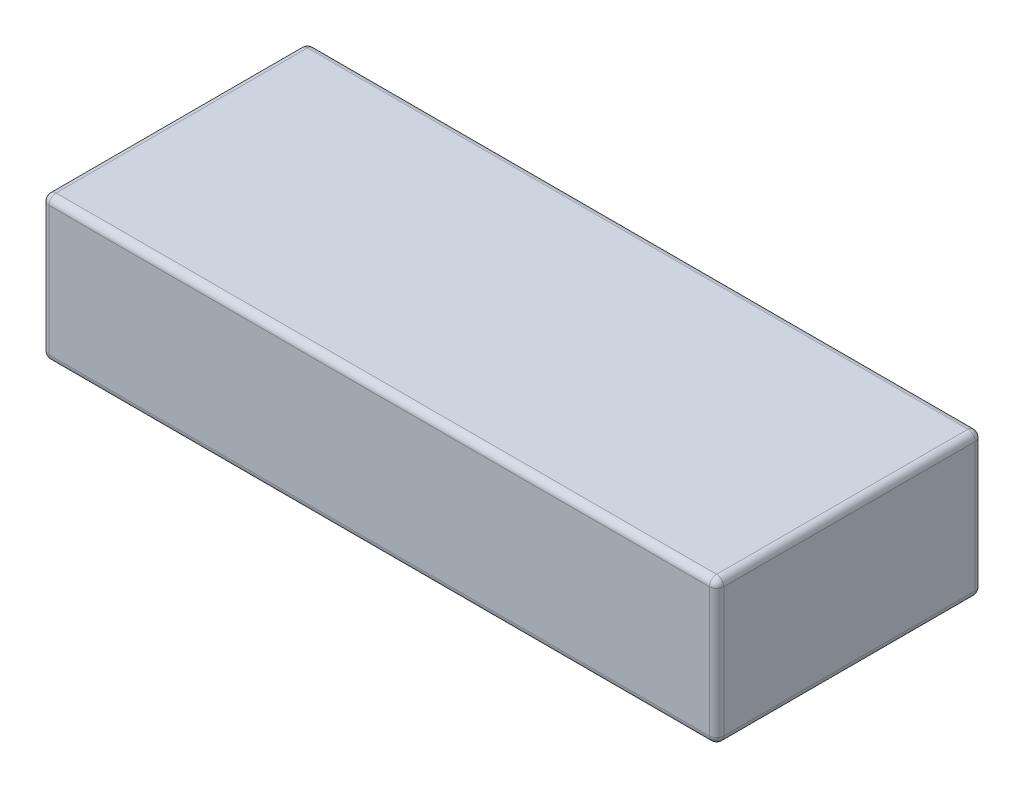
ISO-10303-21;
HEADER;
FILE_DESCRIPTION(('STEP AP214'),'2;1');
FILE_NAME('part.step','',(''),(''),'','','');
FILE_SCHEMA(('AUTOMOTIVE_DESIGN { 1 0 10303 214 1 1 1 1 }'));
ENDSEC;
DATA;
#1=APPLICATION_CONTEXT('core data for automotive mechanical design processes');
#2=APPLICATION_PROTOCOL_DEFINITION('international standard','automotive_design',2000,#1);
#3=PRODUCT_CONTEXT('',#1,'mechanical');
#4=PRODUCT('Part','Part','',(#3));
#5=PRODUCT_RELATED_PRODUCT_CATEGORY('part','',(#4));
#6=PRODUCT_DEFINITION_FORMATION('','',#4);
#7=PRODUCT_DEFINITION_CONTEXT('part definition',#1,'design');
#8=PRODUCT_DEFINITION('design','',#6,#7);
#9=PRODUCT_DEFINITION_SHAPE('','',#8);
#10=(LENGTH_UNIT() NAMED_UNIT(*) SI_UNIT(.MILLI.,.METRE.));
#11=(NAMED_UNIT(*) PLANE_ANGLE_UNIT() SI_UNIT($,.RADIAN.));
#12=(NAMED_UNIT(*) SI_UNIT($,.STERADIAN.) SOLID_ANGLE_UNIT());
#13=UNCERTAINTY_MEASURE_WITH_UNIT(LENGTH_MEASURE(1.E-05),#10,'distance_accuracy_value','');
#14=(GEOMETRIC_REPRESENTATION_CONTEXT(3) GLOBAL_UNCERTAINTY_ASSIGNED_CONTEXT((#13)) GLOBAL_UNIT_ASSIGNED_CONTEXT((#10,
#11,#12)) REPRESENTATION_CONTEXT('',''));
#15=CARTESIAN_POINT('',(0.,0.,0.));
#16=DIRECTION('',(0.,0.,1.));
#17=DIRECTION('',(1.,0.,0.));
#18=AXIS2_PLACEMENT_3D('',#15,#16,#17);
#19=CARTESIAN_POINT('',(0.,20.,0.));
#20=DIRECTION('',(1.,0.,0.));
#21=DIRECTION('',(0.,0.,-1.));
#22=AXIS2_PLACEMENT_3D('',#19,#20,#21);
#23=PLANE('',#22);
#24=DIRECTION('',(0.,-1.,0.));
#25=VECTOR('',#24,1.);
#26=CARTESIAN_POINT('',(0.,20.,-1.));
#27=LINE('',#26,#25);
#28=CARTESIAN_POINT('',(0.,1.,-1.));
#29=VERTEX_POINT('',#28);
#30=CARTESIAN_POINT('',(0.,19.,-1.));
#31=VERTEX_POINT('',#30);
#32=EDGE_CURVE('E131',#29,#31,#27,.F.);
#33=ORIENTED_EDGE('',*,*,#32,.T.);
#34=DIRECTION('',(0.,0.,1.));
#35=VECTOR('',#34,1.);
#36=CARTESIAN_POINT('',(0.,19.,0.));
#37=LINE('',#36,#35);
#38=CARTESIAN_POINT('',(0.,19.,-36.));
#39=VERTEX_POINT('',#38);
#40=EDGE_CURVE('E168',#31,#39,#37,.F.);
#41=ORIENTED_EDGE('',*,*,#40,.T.);
#42=DIRECTION('',(0.,-1.,0.));
#43=VECTOR('',#42,1.);
#44=CARTESIAN_POINT('',(0.,20.,-36.));
#45=LINE('',#44,#43);
#46=CARTESIAN_POINT('',(0.,1.,-36.));
#47=VERTEX_POINT('',#46);
#48=EDGE_CURVE('E165',#39,#47,#45,.T.);
#49=ORIENTED_EDGE('',*,*,#48,.T.);
#50=DIRECTION('',(0.,0.,1.));
#51=VECTOR('',#50,1.);
#52=CARTESIAN_POINT('',(0.,1.,0.));
#53=LINE('',#52,#51);
#54=EDGE_CURVE('E160',#47,#29,#53,.T.);
#55=ORIENTED_EDGE('',*,*,#54,.T.);
#56=EDGE_LOOP('',(#33,#41,#49,#55));
#57=FACE_BOUND('',#56,.T.);
#58=ADVANCED_FACE('F36',(#57),#23,.F.);
#59=CARTESIAN_POINT('',(0.,20.,0.));
#60=DIRECTION('',(0.,0.,-1.));
#61=DIRECTION('',(-1.,0.,0.));
#62=AXIS2_PLACEMENT_3D('',#59,#60,#61);
#63=PLANE('',#62);
#64=DIRECTION('',(0.,-1.,0.));
#65=VECTOR('',#64,1.);
#66=CARTESIAN_POINT('',(93.,20.,0.));
#67=LINE('',#66,#65);
#68=CARTESIAN_POINT('',(93.,1.,0.));
#69=VERTEX_POINT('',#68);
#70=CARTESIAN_POINT('',(93.,19.,0.));
#71=VERTEX_POINT('',#70);
#72=EDGE_CURVE('E153',#69,#71,#67,.F.);
#73=ORIENTED_EDGE('',*,*,#72,.T.);
#74=DIRECTION('',(1.,0.,0.));
#75=VECTOR('',#74,1.);
#76=CARTESIAN_POINT('',(0.,19.,0.));
#77=LINE('',#76,#75);
#78=CARTESIAN_POINT('',(1.,19.,0.));
#79=VERTEX_POINT('',#78);
#80=EDGE_CURVE('E157',#71,#79,#77,.F.);
#81=ORIENTED_EDGE('',*,*,#80,.T.);
#82=DIRECTION('',(0.,-1.,0.));
#83=VECTOR('',#82,1.);
#84=CARTESIAN_POINT('',(1.,20.,0.));
#85=LINE('',#84,#83);
#86=CARTESIAN_POINT('',(1.,1.,0.));
#87=VERTEX_POINT('',#86);
#88=EDGE_CURVE('E129',#79,#87,#85,.T.);
#89=ORIENTED_EDGE('',*,*,#88,.T.);
#90=DIRECTION('',(1.,0.,0.));
#91=VECTOR('',#90,1.);
#92=CARTESIAN_POINT('',(94.,1.,0.));
#93=LINE('',#92,#91);
#94=EDGE_CURVE('E147',#87,#69,#93,.T.);
#95=ORIENTED_EDGE('',*,*,#94,.T.);
#96=EDGE_LOOP('',(#73,#81,#89,#95));
#97=FACE_BOUND('',#96,.T.);
#98=ADVANCED_FACE('F155',(#97),#63,.F.);
#99=CARTESIAN_POINT('',(94.,20.,0.));
#100=DIRECTION('',(-1.,0.,0.));
#101=DIRECTION('',(0.,0.,1.));
#102=AXIS2_PLACEMENT_3D('',#99,#100,#101);
#103=PLANE('',#102);
#104=DIRECTION('',(0.,-1.,0.));
#105=VECTOR('',#104,1.);
#106=CARTESIAN_POINT('',(94.,20.,-36.));
#107=LINE('',#106,#105);
#108=CARTESIAN_POINT('',(94.,1.,-36.));
#109=VERTEX_POINT('',#108);
#110=CARTESIAN_POINT('',(94.,19.,-36.));
#111=VERTEX_POINT('',#110);
#112=EDGE_CURVE('E172',#109,#111,#107,.F.);
#113=ORIENTED_EDGE('',*,*,#112,.T.);
#114=DIRECTION('',(0.,0.,-1.));
#115=VECTOR('',#114,1.);
#116=CARTESIAN_POINT('',(94.,19.,0.));
#117=LINE('',#116,#115);
#118=CARTESIAN_POINT('',(94.,19.,-1.));
#119=VERTEX_POINT('',#118);
#120=EDGE_CURVE('E177',#111,#119,#117,.F.);
#121=ORIENTED_EDGE('',*,*,#120,.T.);
#122=DIRECTION('',(0.,-1.,0.));
#123=VECTOR('',#122,1.);
#124=CARTESIAN_POINT('',(94.,20.,-1.));
#125=LINE('',#124,#123);
#126=CARTESIAN_POINT('',(94.,1.,-1.));
#127=VERTEX_POINT('',#126);
#128=EDGE_CURVE('E174',#119,#127,#125,.T.);
#129=ORIENTED_EDGE('',*,*,#128,.T.);
#130=DIRECTION('',(0.,0.,-1.));
#131=VECTOR('',#130,1.);
#132=CARTESIAN_POINT('',(94.,1.,-37.));
#133=LINE('',#132,#131);
#134=EDGE_CURVE('E170',#127,#109,#133,.T.);
#135=ORIENTED_EDGE('',*,*,#134,.T.);
#136=EDGE_LOOP('',(#113,#121,#129,#135));
#137=FACE_BOUND('',#136,.T.);
#138=ADVANCED_FACE('F282',(#137),#103,.F.);
#139=CARTESIAN_POINT('',(0.,20.,-37.));
#140=DIRECTION('',(0.,0.,1.));
#141=DIRECTION('',(1.,0.,0.));
#142=AXIS2_PLACEMENT_3D('',#139,#140,#141);
#143=PLANE('',#142);
#144=DIRECTION('',(0.,-1.,0.));
#145=VECTOR('',#144,1.);
#146=CARTESIAN_POINT('',(1.00000000000001,20.,-37.));
#147=LINE('',#146,#145);
#148=CARTESIAN_POINT('',(1.00000000000001,1.,-37.));
#149=VERTEX_POINT('',#148);
#150=CARTESIAN_POINT('',(1.00000000000001,19.,-37.));
#151=VERTEX_POINT('',#150);
#152=EDGE_CURVE('E181',#149,#151,#147,.F.);
#153=ORIENTED_EDGE('',*,*,#152,.T.);
#154=DIRECTION('',(-1.,0.,0.));
#155=VECTOR('',#154,1.);
#156=CARTESIAN_POINT('',(0.,19.,-37.));
#157=LINE('',#156,#155);
#158=CARTESIAN_POINT('',(93.,19.,-37.));
#159=VERTEX_POINT('',#158);
#160=EDGE_CURVE('E186',#151,#159,#157,.F.);
#161=ORIENTED_EDGE('',*,*,#160,.T.);
#162=DIRECTION('',(0.,-1.,0.));
#163=VECTOR('',#162,1.);
#164=CARTESIAN_POINT('',(93.,20.,-37.));
#165=LINE('',#164,#163);
#166=CARTESIAN_POINT('',(93.,1.,-37.));
#167=VERTEX_POINT('',#166);
#168=EDGE_CURVE('E183',#159,#167,#165,.T.);
#169=ORIENTED_EDGE('',*,*,#168,.T.);
#170=DIRECTION('',(-1.,0.,0.));
#171=VECTOR('',#170,1.);
#172=CARTESIAN_POINT('',(0.,1.,-37.));
#173=LINE('',#172,#171);
#174=EDGE_CURVE('E179',#167,#149,#173,.T.);
#175=ORIENTED_EDGE('',*,*,#174,.T.);
#176=EDGE_LOOP('',(#153,#161,#169,#175));
#177=FACE_BOUND('',#176,.T.);
#178=ADVANCED_FACE('F292',(#177),#143,.F.);
#179=CARTESIAN_POINT('',(0.,20.,0.));
#180=DIRECTION('',(0.,-1.,0.));
#181=DIRECTION('',(0.,0.,-1.));
#182=AXIS2_PLACEMENT_3D('',#179,#180,#181);
#183=PLANE('',#182);
#184=DIRECTION('',(0.,0.,-1.));
#185=VECTOR('',#184,1.);
#186=CARTESIAN_POINT('',(93.,20.,0.));
#187=LINE('',#186,#185);
#188=CARTESIAN_POINT('',(93.,20.,-1.));
#189=VERTEX_POINT('',#188);
#190=CARTESIAN_POINT('',(93.,20.,-36.));
#191=VERTEX_POINT('',#190);
#192=EDGE_CURVE('E192',#189,#191,#187,.T.);
#193=ORIENTED_EDGE('',*,*,#192,.T.);
#194=DIRECTION('',(-1.,0.,0.));
#195=VECTOR('',#194,1.);
#196=CARTESIAN_POINT('',(0.,20.,-36.));
#197=LINE('',#196,#195);
#198=CARTESIAN_POINT('',(1.00000000000001,20.,-36.));
#199=VERTEX_POINT('',#198);
#200=EDGE_CURVE('E194',#191,#199,#197,.T.);
#201=ORIENTED_EDGE('',*,*,#200,.T.);
#202=DIRECTION('',(0.,0.,1.));
#203=VECTOR('',#202,1.);
#204=CARTESIAN_POINT('',(1.,20.,0.));
#205=LINE('',#204,#203);
#206=CARTESIAN_POINT('',(1.,20.,-1.));
#207=VERTEX_POINT('',#206);
#208=EDGE_CURVE('E188',#199,#207,#205,.T.);
#209=ORIENTED_EDGE('',*,*,#208,.T.);
#210=DIRECTION('',(1.,0.,0.));
#211=VECTOR('',#210,1.);
#212=CARTESIAN_POINT('',(0.,20.,-1.));
#213=LINE('',#212,#211);
#214=EDGE_CURVE('E190',#207,#189,#213,.T.);
#215=ORIENTED_EDGE('',*,*,#214,.T.);
#216=EDGE_LOOP('',(#193,#201,#209,#215));
#217=FACE_BOUND('',#216,.T.);
#218=ADVANCED_FACE('F274',(#217),#183,.F.);
#219=CARTESIAN_POINT('',(0.,0.,0.));
#220=DIRECTION('',(0.,-1.,0.));
#221=DIRECTION('',(0.,0.,-1.));
#222=AXIS2_PLACEMENT_3D('',#219,#220,#221);
#223=PLANE('',#222);
#224=DIRECTION('',(0.,0.,1.));
#225=VECTOR('',#224,1.);
#226=CARTESIAN_POINT('',(1.00000000000001,0.,-37.));
#227=LINE('',#226,#225);
#228=CARTESIAN_POINT('',(1.,0.,-1.));
#229=VERTEX_POINT('',#228);
#230=CARTESIAN_POINT('',(1.00000000000001,0.,-36.));
#231=VERTEX_POINT('',#230);
#232=EDGE_CURVE('E197',#229,#231,#227,.F.);
#233=ORIENTED_EDGE('',*,*,#232,.T.);
#234=DIRECTION('',(-1.,0.,0.));
#235=VECTOR('',#234,1.);
#236=CARTESIAN_POINT('',(94.,0.,-36.));
#237=LINE('',#236,#235);
#238=CARTESIAN_POINT('',(93.,0.,-36.));
#239=VERTEX_POINT('',#238);
#240=EDGE_CURVE('E11',#231,#239,#237,.F.);
#241=ORIENTED_EDGE('',*,*,#240,.T.);
#242=DIRECTION('',(0.,0.,-1.));
#243=VECTOR('',#242,1.);
#244=CARTESIAN_POINT('',(93.,0.,0.));
#245=LINE('',#244,#243);
#246=CARTESIAN_POINT('',(93.,0.,-1.));
#247=VERTEX_POINT('',#246);
#248=EDGE_CURVE('E45',#239,#247,#245,.F.);
#249=ORIENTED_EDGE('',*,*,#248,.T.);
#250=DIRECTION('',(1.,0.,0.));
#251=VECTOR('',#250,1.);
#252=CARTESIAN_POINT('',(0.,0.,-1.));
#253=LINE('',#252,#251);
#254=EDGE_CURVE('E199',#247,#229,#253,.F.);
#255=ORIENTED_EDGE('',*,*,#254,.T.);
#256=EDGE_LOOP('',(#233,#241,#249,#255));
#257=FACE_BOUND('',#256,.T.);
#258=ADVANCED_FACE('F520',(#257),#223,.T.);
#259=CARTESIAN_POINT('',(93.,20.,-36.));
#260=DIRECTION('',(0.,-1.,0.));
#261=DIRECTION('',(0.,0.,-1.));
#262=AXIS2_PLACEMENT_3D('',#259,#260,#261);
#263=CYLINDRICAL_SURFACE('',#262,1.);
#264=CARTESIAN_POINT('',(93.,19.,-36.));
#265=DIRECTION('',(0.,1.,0.));
#266=DIRECTION('',(0.,0.,1.));
#267=AXIS2_PLACEMENT_3D('',#264,#265,#266);
#268=CIRCLE('',#267,1.);
#269=EDGE_CURVE('E40',#111,#159,#268,.T.);
#270=ORIENTED_EDGE('',*,*,#269,.F.);
#271=ORIENTED_EDGE('',*,*,#112,.F.);
#272=CARTESIAN_POINT('',(93.,1.,-36.));
#273=DIRECTION('',(0.,-1.,0.));
#274=DIRECTION('',(0.,0.,-1.));
#275=AXIS2_PLACEMENT_3D('',#272,#273,#274);
#276=CIRCLE('',#275,1.);
#277=EDGE_CURVE('E252',#167,#109,#276,.T.);
#278=ORIENTED_EDGE('',*,*,#277,.F.);
#279=ORIENTED_EDGE('',*,*,#168,.F.);
#280=EDGE_LOOP('',(#270,#271,#278,#279));
#281=FACE_BOUND('',#280,.T.);
#282=ADVANCED_FACE('F38',(#281),#263,.T.);
#283=CARTESIAN_POINT('',(93.,19.,-36.));
#284=DIRECTION('',(0.,0.,-1.));
#285=DIRECTION('',(-1.,0.,0.));
#286=AXIS2_PLACEMENT_3D('',#283,#284,#285);
#287=SPHERICAL_SURFACE('',#286,1.);
#288=CARTESIAN_POINT('',(93.,19.,-36.));
#289=DIRECTION('',(0.,0.,-1.));
#290=DIRECTION('',(-1.,0.,0.));
#291=AXIS2_PLACEMENT_3D('',#288,#289,#290);
#292=CIRCLE('',#291,1.);
#293=EDGE_CURVE('E247',#111,#191,#292,.F.);
#294=ORIENTED_EDGE('',*,*,#293,.F.);
#295=ORIENTED_EDGE('',*,*,#269,.T.);
#296=CARTESIAN_POINT('',(93.,19.,-36.));
#297=DIRECTION('',(1.,0.,0.));
#298=DIRECTION('',(0.,0.,-1.));
#299=AXIS2_PLACEMENT_3D('',#296,#297,#298);
#300=CIRCLE('',#299,1.);
#301=EDGE_CURVE('E250',#191,#159,#300,.F.);
#302=ORIENTED_EDGE('',*,*,#301,.F.);
#303=EDGE_LOOP('',(#294,#295,#302));
#304=FACE_BOUND('',#303,.T.);
#305=ADVANCED_FACE('F262',(#304),#287,.T.);
#306=CARTESIAN_POINT('',(93.,1.,-36.));
#307=DIRECTION('',(1.,0.,0.));
#308=DIRECTION('',(0.,1.,0.));
#309=AXIS2_PLACEMENT_3D('',#306,#307,#308);
#310=SPHERICAL_SURFACE('',#309,1.);
#311=CARTESIAN_POINT('',(93.,1.,-36.));
#312=DIRECTION('',(1.,0.,0.));
#313=DIRECTION('',(0.,0.,-1.));
#314=AXIS2_PLACEMENT_3D('',#311,#312,#313);
#315=CIRCLE('',#314,1.);
#316=EDGE_CURVE('E242',#167,#239,#315,.F.);
#317=ORIENTED_EDGE('',*,*,#316,.F.);
#318=ORIENTED_EDGE('',*,*,#277,.T.);
#319=CARTESIAN_POINT('',(93.,1.,-36.));
#320=DIRECTION('',(0.,0.,-1.));
#321=DIRECTION('',(-1.,0.,0.));
#322=AXIS2_PLACEMENT_3D('',#319,#320,#321);
#323=CIRCLE('',#322,1.);
#324=EDGE_CURVE('E245',#239,#109,#323,.F.);
#325=ORIENTED_EDGE('',*,*,#324,.F.);
#326=EDGE_LOOP('',(#317,#318,#325));
#327=FACE_BOUND('',#326,.T.);
#328=ADVANCED_FACE('F493',(#327),#310,.T.);
#329=CARTESIAN_POINT('',(0.,19.,-36.));
#330=DIRECTION('',(-1.,0.,0.));
#331=DIRECTION('',(0.,0.,1.));
#332=AXIS2_PLACEMENT_3D('',#329,#330,#331);
#333=CYLINDRICAL_SURFACE('',#332,1.);
#334=ORIENTED_EDGE('',*,*,#301,.T.);
#335=ORIENTED_EDGE('',*,*,#160,.F.);
#336=CARTESIAN_POINT('',(1.00000000000001,19.,-36.));
#337=DIRECTION('',(-1.,0.,0.));
#338=DIRECTION('',(0.,0.,1.));
#339=AXIS2_PLACEMENT_3D('',#336,#337,#338);
#340=CIRCLE('',#339,1.);
#341=EDGE_CURVE('E236',#199,#151,#340,.T.);
#342=ORIENTED_EDGE('',*,*,#341,.F.);
#343=ORIENTED_EDGE('',*,*,#200,.F.);
#344=EDGE_LOOP('',(#334,#335,#342,#343));
#345=FACE_BOUND('',#344,.T.);
#346=ADVANCED_FACE('F270',(#345),#333,.T.);
#347=CARTESIAN_POINT('',(93.,19.,0.));
#348=DIRECTION('',(0.,0.,-1.));
#349=DIRECTION('',(-1.,0.,0.));
#350=AXIS2_PLACEMENT_3D('',#347,#348,#349);
#351=CYLINDRICAL_SURFACE('',#350,1.);
#352=ORIENTED_EDGE('',*,*,#293,.T.);
#353=ORIENTED_EDGE('',*,*,#192,.F.);
#354=CARTESIAN_POINT('',(93.,19.,-1.));
#355=DIRECTION('',(0.,0.,1.));
#356=DIRECTION('',(1.,0.,0.));
#357=AXIS2_PLACEMENT_3D('',#354,#355,#356);
#358=CIRCLE('',#357,1.);
#359=EDGE_CURVE('E233',#119,#189,#358,.T.);
#360=ORIENTED_EDGE('',*,*,#359,.F.);
#361=ORIENTED_EDGE('',*,*,#120,.F.);
#362=EDGE_LOOP('',(#352,#353,#360,#361));
#363=FACE_BOUND('',#362,.T.);
#364=ADVANCED_FACE('F279',(#363),#351,.T.);
#365=CARTESIAN_POINT('',(93.,20.,-1.));
#366=DIRECTION('',(0.,-1.,0.));
#367=DIRECTION('',(0.,0.,-1.));
#368=AXIS2_PLACEMENT_3D('',#365,#366,#367);
#369=CYLINDRICAL_SURFACE('',#368,1.);
#370=CARTESIAN_POINT('',(93.,1.,-1.));
#371=DIRECTION('',(0.,-1.,0.));
#372=DIRECTION('',(0.,0.,-1.));
#373=AXIS2_PLACEMENT_3D('',#370,#371,#372);
#374=CIRCLE('',#373,1.);
#375=EDGE_CURVE('E227',#127,#69,#374,.T.);
#376=ORIENTED_EDGE('',*,*,#375,.F.);
#377=ORIENTED_EDGE('',*,*,#128,.F.);
#378=CARTESIAN_POINT('',(93.,19.,-1.));
#379=DIRECTION('',(0.,1.,0.));
#380=DIRECTION('',(0.,0.,1.));
#381=AXIS2_PLACEMENT_3D('',#378,#379,#380);
#382=CIRCLE('',#381,1.);
#383=EDGE_CURVE('E230',#71,#119,#382,.T.);
#384=ORIENTED_EDGE('',*,*,#383,.F.);
#385=ORIENTED_EDGE('',*,*,#72,.F.);
#386=EDGE_LOOP('',(#376,#377,#384,#385));
#387=FACE_BOUND('',#386,.T.);
#388=ADVANCED_FACE('F286',(#387),#369,.T.);
#389=CARTESIAN_POINT('',(93.,1.,0.));
#390=DIRECTION('',(0.,0.,1.));
#391=DIRECTION('',(1.,0.,0.));
#392=AXIS2_PLACEMENT_3D('',#389,#390,#391);
#393=CYLINDRICAL_SURFACE('',#392,1.);
#394=ORIENTED_EDGE('',*,*,#324,.T.);
#395=ORIENTED_EDGE('',*,*,#134,.F.);
#396=CARTESIAN_POINT('',(93.,1.,-1.));
#397=DIRECTION('',(0.,0.,1.));
#398=DIRECTION('',(1.,0.,0.));
#399=AXIS2_PLACEMENT_3D('',#396,#397,#398);
#400=CIRCLE('',#399,1.);
#401=EDGE_CURVE('E225',#247,#127,#400,.T.);
#402=ORIENTED_EDGE('',*,*,#401,.F.);
#403=ORIENTED_EDGE('',*,*,#248,.F.);
#404=EDGE_LOOP('',(#394,#395,#402,#403));
#405=FACE_BOUND('',#404,.T.);
#406=ADVANCED_FACE('F290',(#405),#393,.T.);
#407=CARTESIAN_POINT('',(0.,1.,-36.));
#408=DIRECTION('',(1.,0.,0.));
#409=DIRECTION('',(0.,0.,-1.));
#410=AXIS2_PLACEMENT_3D('',#407,#408,#409);
#411=CYLINDRICAL_SURFACE('',#410,1.);
#412=ORIENTED_EDGE('',*,*,#316,.T.);
#413=ORIENTED_EDGE('',*,*,#240,.F.);
#414=CARTESIAN_POINT('',(1.00000000000001,1.,-36.));
#415=DIRECTION('',(-1.,0.,0.));
#416=DIRECTION('',(0.,0.,1.));
#417=AXIS2_PLACEMENT_3D('',#414,#415,#416);
#418=CIRCLE('',#417,1.);
#419=EDGE_CURVE('E222',#149,#231,#418,.T.);
#420=ORIENTED_EDGE('',*,*,#419,.F.);
#421=ORIENTED_EDGE('',*,*,#174,.F.);
#422=EDGE_LOOP('',(#412,#413,#420,#421));
#423=FACE_BOUND('',#422,.T.);
#424=ADVANCED_FACE('F302',(#423),#411,.T.);
#425=CARTESIAN_POINT('',(1.00000000000001,20.,-36.));
#426=DIRECTION('',(0.,-1.,0.));
#427=DIRECTION('',(0.,0.,-1.));
#428=AXIS2_PLACEMENT_3D('',#425,#426,#427);
#429=CYLINDRICAL_SURFACE('',#428,1.);
#430=CARTESIAN_POINT('',(1.00000000000001,19.,-36.));
#431=DIRECTION('',(0.,1.,0.));
#432=DIRECTION('',(0.,0.,1.));
#433=AXIS2_PLACEMENT_3D('',#430,#431,#432);
#434=CIRCLE('',#433,1.);
#435=EDGE_CURVE('E239',#151,#39,#434,.T.);
#436=ORIENTED_EDGE('',*,*,#435,.F.);
#437=ORIENTED_EDGE('',*,*,#152,.F.);
#438=CARTESIAN_POINT('',(1.00000000000001,1.,-36.));
#439=DIRECTION('',(0.,-1.,0.));
#440=DIRECTION('',(0.,0.,-1.));
#441=AXIS2_PLACEMENT_3D('',#438,#439,#440);
#442=CIRCLE('',#441,1.);
#443=EDGE_CURVE('E219',#47,#149,#442,.T.);
#444=ORIENTED_EDGE('',*,*,#443,.F.);
#445=ORIENTED_EDGE('',*,*,#48,.F.);
#446=EDGE_LOOP('',(#436,#437,#444,#445));
#447=FACE_BOUND('',#446,.T.);
#448=ADVANCED_FACE('F297',(#447),#429,.T.);
#449=CARTESIAN_POINT('',(1.00000000000001,19.,-36.));
#450=DIRECTION('',(0.,0.,-1.));
#451=DIRECTION('',(-1.,0.,0.));
#452=AXIS2_PLACEMENT_3D('',#449,#450,#451);
#453=SPHERICAL_SURFACE('',#452,1.);
#454=ORIENTED_EDGE('',*,*,#341,.T.);
#455=ORIENTED_EDGE('',*,*,#435,.T.);
#456=CARTESIAN_POINT('',(1.00000000000001,19.,-36.));
#457=DIRECTION('',(0.,0.,-1.));
#458=DIRECTION('',(-1.,0.,0.));
#459=AXIS2_PLACEMENT_3D('',#456,#457,#458);
#460=CIRCLE('',#459,1.);
#461=EDGE_CURVE('E216',#199,#39,#460,.F.);
#462=ORIENTED_EDGE('',*,*,#461,.F.);
#463=EDGE_LOOP('',(#454,#455,#462));
#464=FACE_BOUND('',#463,.T.);
#465=ADVANCED_FACE('F313',(#464),#453,.T.);
#466=CARTESIAN_POINT('',(93.,19.,-1.));
#467=DIRECTION('',(1.,0.,0.));
#468=DIRECTION('',(0.,0.,-1.));
#469=AXIS2_PLACEMENT_3D('',#466,#467,#468);
#470=SPHERICAL_SURFACE('',#469,1.);
#471=ORIENTED_EDGE('',*,*,#383,.T.);
#472=ORIENTED_EDGE('',*,*,#359,.T.);
#473=CARTESIAN_POINT('',(93.,19.,-1.));
#474=DIRECTION('',(1.,0.,0.));
#475=DIRECTION('',(0.,0.,-1.));
#476=AXIS2_PLACEMENT_3D('',#473,#474,#475);
#477=CIRCLE('',#476,1.);
#478=EDGE_CURVE('E213',#71,#189,#477,.F.);
#479=ORIENTED_EDGE('',*,*,#478,.F.);
#480=EDGE_LOOP('',(#471,#472,#479));
#481=FACE_BOUND('',#480,.T.);
#482=ADVANCED_FACE('F323',(#481),#470,.T.);
#483=CARTESIAN_POINT('',(93.,1.,-1.));
#484=DIRECTION('',(1.,0.,0.));
#485=DIRECTION('',(0.,1.,0.));
#486=AXIS2_PLACEMENT_3D('',#483,#484,#485);
#487=SPHERICAL_SURFACE('',#486,1.);
#488=ORIENTED_EDGE('',*,*,#401,.T.);
#489=ORIENTED_EDGE('',*,*,#375,.T.);
#490=CARTESIAN_POINT('',(93.,1.,-1.));
#491=DIRECTION('',(1.,0.,0.));
#492=DIRECTION('',(0.,0.,-1.));
#493=AXIS2_PLACEMENT_3D('',#490,#491,#492);
#494=CIRCLE('',#493,1.);
#495=EDGE_CURVE('E150',#247,#69,#494,.F.);
#496=ORIENTED_EDGE('',*,*,#495,.F.);
#497=EDGE_LOOP('',(#488,#489,#496));
#498=FACE_BOUND('',#497,.T.);
#499=ADVANCED_FACE('F325',(#498),#487,.T.);
#500=CARTESIAN_POINT('',(1.00000000000001,1.,-36.));
#501=DIRECTION('',(0.,0.,-1.));
#502=DIRECTION('',(0.,1.,0.));
#503=AXIS2_PLACEMENT_3D('',#500,#501,#502);
#504=SPHERICAL_SURFACE('',#503,1.);
#505=ORIENTED_EDGE('',*,*,#443,.T.);
#506=ORIENTED_EDGE('',*,*,#419,.T.);
#507=CARTESIAN_POINT('',(1.00000000000001,1.,-36.));
#508=DIRECTION('',(0.,0.,-1.));
#509=DIRECTION('',(-1.,0.,0.));
#510=AXIS2_PLACEMENT_3D('',#507,#508,#509);
#511=CIRCLE('',#510,1.);
#512=EDGE_CURVE('E209',#47,#231,#511,.F.);
#513=ORIENTED_EDGE('',*,*,#512,.F.);
#514=EDGE_LOOP('',(#505,#506,#513));
#515=FACE_BOUND('',#514,.T.);
#516=ADVANCED_FACE('F304',(#515),#504,.T.);
#517=CARTESIAN_POINT('',(1.,19.,0.));
#518=DIRECTION('',(0.,0.,1.));
#519=DIRECTION('',(1.,0.,0.));
#520=AXIS2_PLACEMENT_3D('',#517,#518,#519);
#521=CYLINDRICAL_SURFACE('',#520,1.);
#522=ORIENTED_EDGE('',*,*,#461,.T.);
#523=ORIENTED_EDGE('',*,*,#40,.F.);
#524=CARTESIAN_POINT('',(1.,19.,-1.));
#525=DIRECTION('',(0.,0.,1.));
#526=DIRECTION('',(1.,0.,0.));
#527=AXIS2_PLACEMENT_3D('',#524,#525,#526);
#528=CIRCLE('',#527,1.);
#529=EDGE_CURVE('E206',#207,#31,#528,.T.);
#530=ORIENTED_EDGE('',*,*,#529,.F.);
#531=ORIENTED_EDGE('',*,*,#208,.F.);
#532=EDGE_LOOP('',(#522,#523,#530,#531));
#533=FACE_BOUND('',#532,.T.);
#534=ADVANCED_FACE('F315',(#533),#521,.T.);
#535=CARTESIAN_POINT('',(0.,19.,-1.));
#536=DIRECTION('',(1.,0.,0.));
#537=DIRECTION('',(0.,0.,-1.));
#538=AXIS2_PLACEMENT_3D('',#535,#536,#537);
#539=CYLINDRICAL_SURFACE('',#538,1.);
#540=ORIENTED_EDGE('',*,*,#478,.T.);
#541=ORIENTED_EDGE('',*,*,#214,.F.);
#542=CARTESIAN_POINT('',(1.,19.,-1.));
#543=DIRECTION('',(-1.,0.,0.));
#544=DIRECTION('',(0.,0.,1.));
#545=AXIS2_PLACEMENT_3D('',#542,#543,#544);
#546=CIRCLE('',#545,1.);
#547=EDGE_CURVE('E144',#79,#207,#546,.T.);
#548=ORIENTED_EDGE('',*,*,#547,.F.);
#549=ORIENTED_EDGE('',*,*,#80,.F.);
#550=EDGE_LOOP('',(#540,#541,#548,#549));
#551=FACE_BOUND('',#550,.T.);
#552=ADVANCED_FACE('F321',(#551),#539,.T.);
#553=CARTESIAN_POINT('',(0.,1.,-1.));
#554=DIRECTION('',(-1.,0.,0.));
#555=DIRECTION('',(0.,0.,1.));
#556=AXIS2_PLACEMENT_3D('',#553,#554,#555);
#557=CYLINDRICAL_SURFACE('',#556,1.);
#558=ORIENTED_EDGE('',*,*,#495,.T.);
#559=ORIENTED_EDGE('',*,*,#94,.F.);
#560=CARTESIAN_POINT('',(1.,1.,-1.));
#561=DIRECTION('',(-1.,0.,0.));
#562=DIRECTION('',(0.,0.,1.));
#563=AXIS2_PLACEMENT_3D('',#560,#561,#562);
#564=CIRCLE('',#563,1.);
#565=EDGE_CURVE('E137',#229,#87,#564,.T.);
#566=ORIENTED_EDGE('',*,*,#565,.F.);
#567=ORIENTED_EDGE('',*,*,#254,.F.);
#568=EDGE_LOOP('',(#558,#559,#566,#567));
#569=FACE_BOUND('',#568,.T.);
#570=ADVANCED_FACE('F148',(#569),#557,.T.);
#571=CARTESIAN_POINT('',(1.,1.,0.));
#572=DIRECTION('',(0.,0.,-1.));
#573=DIRECTION('',(-1.,0.,0.));
#574=AXIS2_PLACEMENT_3D('',#571,#572,#573);
#575=CYLINDRICAL_SURFACE('',#574,1.);
#576=ORIENTED_EDGE('',*,*,#512,.T.);
#577=ORIENTED_EDGE('',*,*,#232,.F.);
#578=CARTESIAN_POINT('',(1.,1.,-1.));
#579=DIRECTION('',(0.,0.,1.));
#580=DIRECTION('',(1.,0.,0.));
#581=AXIS2_PLACEMENT_3D('',#578,#579,#580);
#582=CIRCLE('',#581,1.);
#583=EDGE_CURVE('E141',#29,#229,#582,.T.);
#584=ORIENTED_EDGE('',*,*,#583,.F.);
#585=ORIENTED_EDGE('',*,*,#54,.F.);
#586=EDGE_LOOP('',(#576,#577,#584,#585));
#587=FACE_BOUND('',#586,.T.);
#588=ADVANCED_FACE('F308',(#587),#575,.T.);
#589=CARTESIAN_POINT('',(1.,19.,-1.));
#590=DIRECTION('',(0.,1.,0.));
#591=DIRECTION('',(0.,0.,1.));
#592=AXIS2_PLACEMENT_3D('',#589,#590,#591);
#593=SPHERICAL_SURFACE('',#592,1.);
#594=ORIENTED_EDGE('',*,*,#547,.T.);
#595=ORIENTED_EDGE('',*,*,#529,.T.);
#596=CARTESIAN_POINT('',(1.,19.,-1.));
#597=DIRECTION('',(0.,1.,0.));
#598=DIRECTION('',(0.,0.,1.));
#599=AXIS2_PLACEMENT_3D('',#596,#597,#598);
#600=CIRCLE('',#599,1.);
#601=EDGE_CURVE('E134',#79,#31,#600,.F.);
#602=ORIENTED_EDGE('',*,*,#601,.F.);
#603=EDGE_LOOP('',(#594,#595,#602));
#604=FACE_BOUND('',#603,.T.);
#605=ADVANCED_FACE('F319',(#604),#593,.T.);
#606=CARTESIAN_POINT('',(1.,1.,-1.));
#607=DIRECTION('',(0.,-1.,0.));
#608=DIRECTION('',(0.,0.,-1.));
#609=AXIS2_PLACEMENT_3D('',#606,#607,#608);
#610=SPHERICAL_SURFACE('',#609,1.);
#611=ORIENTED_EDGE('',*,*,#583,.T.);
#612=ORIENTED_EDGE('',*,*,#565,.T.);
#613=CARTESIAN_POINT('',(1.,1.,-1.));
#614=DIRECTION('',(0.,-1.,0.));
#615=DIRECTION('',(0.,0.,-1.));
#616=AXIS2_PLACEMENT_3D('',#613,#614,#615);
#617=CIRCLE('',#616,1.);
#618=EDGE_CURVE('E125',#29,#87,#617,.F.);
#619=ORIENTED_EDGE('',*,*,#618,.F.);
#620=EDGE_LOOP('',(#611,#612,#619));
#621=FACE_BOUND('',#620,.T.);
#622=ADVANCED_FACE('F139',(#621),#610,.T.);
#623=CARTESIAN_POINT('',(1.,20.,-1.));
#624=DIRECTION('',(0.,-1.,0.));
#625=DIRECTION('',(0.,0.,-1.));
#626=AXIS2_PLACEMENT_3D('',#623,#624,#625);
#627=CYLINDRICAL_SURFACE('',#626,1.);
#628=ORIENTED_EDGE('',*,*,#601,.T.);
#629=ORIENTED_EDGE('',*,*,#32,.F.);
#630=ORIENTED_EDGE('',*,*,#618,.T.);
#631=ORIENTED_EDGE('',*,*,#88,.F.);
#632=EDGE_LOOP('',(#628,#629,#630,#631));
#633=FACE_BOUND('',#632,.T.);
#634=ADVANCED_FACE('F127',(#633),#627,.T.);
#635=CLOSED_SHELL('',(#58,#98,#138,#178,#218,#258,#282,#305,#328,#346,#364,#388,#406,#424,#448,
#465,#482,#499,#516,#534,#552,#570,#588,#605,#622,#634));
#636=MANIFOLD_SOLID_BREP('B2',#635);
#637=ADVANCED_BREP_SHAPE_REPRESENTATION('',(#18,#636),#14);
#638=SHAPE_DEFINITION_REPRESENTATION(#9,#637);
ENDSEC;
END-ISO-10303-21;
